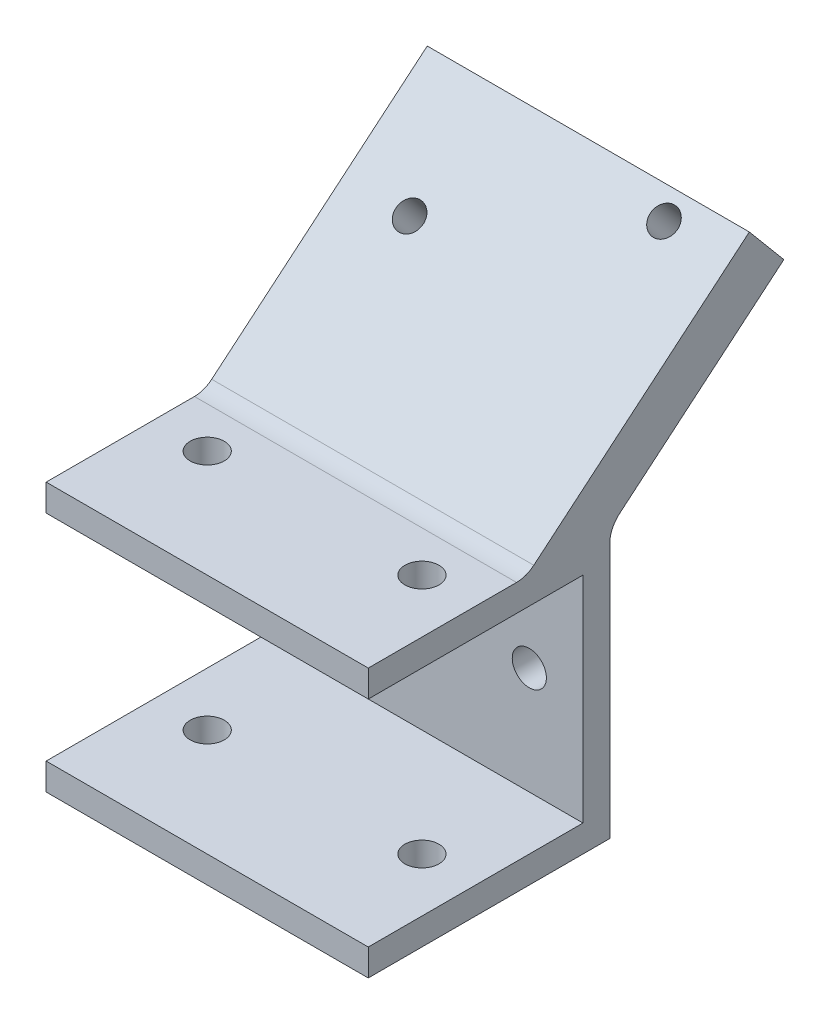
ISO-10303-21;
HEADER;
FILE_DESCRIPTION(('STEP AP214'),'2;1');
FILE_NAME('part.step','',(''),(''),'','','');
FILE_SCHEMA(('AUTOMOTIVE_DESIGN { 1 0 10303 214 1 1 1 1 }'));
ENDSEC;
DATA;
#1=APPLICATION_CONTEXT('core data for automotive mechanical design processes');
#2=APPLICATION_PROTOCOL_DEFINITION('international standard','automotive_design',2000,#1);
#3=PRODUCT_CONTEXT('',#1,'mechanical');
#4=PRODUCT('Part','Part','',(#3));
#5=PRODUCT_RELATED_PRODUCT_CATEGORY('part','',(#4));
#6=PRODUCT_DEFINITION_FORMATION('','',#4);
#7=PRODUCT_DEFINITION_CONTEXT('part definition',#1,'design');
#8=PRODUCT_DEFINITION('design','',#6,#7);
#9=PRODUCT_DEFINITION_SHAPE('','',#8);
#10=(LENGTH_UNIT() NAMED_UNIT(*) SI_UNIT(.MILLI.,.METRE.));
#11=(NAMED_UNIT(*) PLANE_ANGLE_UNIT() SI_UNIT($,.RADIAN.));
#12=(NAMED_UNIT(*) SI_UNIT($,.STERADIAN.) SOLID_ANGLE_UNIT());
#13=UNCERTAINTY_MEASURE_WITH_UNIT(LENGTH_MEASURE(1.E-05),#10,'distance_accuracy_value','');
#14=(GEOMETRIC_REPRESENTATION_CONTEXT(3) GLOBAL_UNCERTAINTY_ASSIGNED_CONTEXT((#13)) GLOBAL_UNIT_ASSIGNED_CONTEXT((#10,
#11,#12)) REPRESENTATION_CONTEXT('',''));
#15=CARTESIAN_POINT('',(0.,0.,0.));
#16=DIRECTION('',(0.,0.,1.));
#17=DIRECTION('',(1.,0.,0.));
#18=AXIS2_PLACEMENT_3D('',#15,#16,#17);
#19=CARTESIAN_POINT('',(38.1,15.875,12.7));
#20=DIRECTION('',(0.,-1.,0.));
#21=DIRECTION('',(0.,0.,-1.));
#22=AXIS2_PLACEMENT_3D('',#19,#20,#21);
#23=PLANE('',#22);
#24=CARTESIAN_POINT('',(31.75,15.875,0.));
#25=DIRECTION('',(0.,1.,0.));
#26=DIRECTION('',(0.,0.,1.));
#27=AXIS2_PLACEMENT_3D('',#24,#25,#26);
#28=CIRCLE('',#27,2.0193);
#29=CARTESIAN_POINT('',(31.75,15.875,2.0193));
#30=VERTEX_POINT('',#29);
#31=EDGE_CURVE('E167',#30,#30,#28,.T.);
#32=ORIENTED_EDGE('',*,*,#31,.F.);
#33=EDGE_LOOP('',(#32));
#34=FACE_BOUND('',#33,.T.);
#35=CARTESIAN_POINT('',(6.35,15.875,0.));
#36=DIRECTION('',(0.,1.,0.));
#37=DIRECTION('',(0.,0.,1.));
#38=AXIS2_PLACEMENT_3D('',#35,#36,#37);
#39=CIRCLE('',#38,2.0193);
#40=CARTESIAN_POINT('',(6.35,15.875,2.0193));
#41=VERTEX_POINT('',#40);
#42=EDGE_CURVE('E169',#41,#41,#39,.T.);
#43=ORIENTED_EDGE('',*,*,#42,.F.);
#44=EDGE_LOOP('',(#43));
#45=FACE_BOUND('',#44,.T.);
#46=DIRECTION('',(0.,0.,1.));
#47=VECTOR('',#46,1.);
#48=CARTESIAN_POINT('',(38.1,15.875,12.7));
#49=LINE('',#48,#47);
#50=CARTESIAN_POINT('',(38.1,15.875,-4.84051284062466));
#51=VERTEX_POINT('',#50);
#52=CARTESIAN_POINT('',(38.1,15.875,12.7));
#53=VERTEX_POINT('',#52);
#54=EDGE_CURVE('E192',#51,#53,#49,.T.);
#55=ORIENTED_EDGE('',*,*,#54,.F.);
#56=DIRECTION('',(1.,0.,0.));
#57=VECTOR('',#56,1.);
#58=CARTESIAN_POINT('',(38.1,15.875,-4.84051284062466));
#59=LINE('',#58,#57);
#60=CARTESIAN_POINT('',(0.,15.875,-4.84051284062466));
#61=VERTEX_POINT('',#60);
#62=EDGE_CURVE('E60',#51,#61,#59,.F.);
#63=ORIENTED_EDGE('',*,*,#62,.T.);
#64=DIRECTION('',(0.,0.,1.));
#65=VECTOR('',#64,1.);
#66=CARTESIAN_POINT('',(0.,15.875,12.7));
#67=LINE('',#66,#65);
#68=CARTESIAN_POINT('',(0.,15.875,12.7));
#69=VERTEX_POINT('',#68);
#70=EDGE_CURVE('E210',#61,#69,#67,.T.);
#71=ORIENTED_EDGE('',*,*,#70,.T.);
#72=DIRECTION('',(-1.,0.,0.));
#73=VECTOR('',#72,1.);
#74=CARTESIAN_POINT('',(38.1,15.875,12.7));
#75=LINE('',#74,#73);
#76=EDGE_CURVE('E240',#53,#69,#75,.T.);
#77=ORIENTED_EDGE('',*,*,#76,.F.);
#78=EDGE_LOOP('',(#55,#63,#71,#77));
#79=FACE_BOUND('',#78,.T.);
#80=ADVANCED_FACE('F37',(#34,#45,#79),#23,.F.);
#81=CARTESIAN_POINT('',(38.1,-15.875,-15.875));
#82=DIRECTION('',(0.,0.,1.));
#83=DIRECTION('',(1.,0.,0.));
#84=AXIS2_PLACEMENT_3D('',#81,#82,#83);
#85=PLANE('',#84);
#86=CARTESIAN_POINT('',(6.35,0.,-15.875));
#87=DIRECTION('',(0.,0.,-1.));
#88=DIRECTION('',(0.,1.,0.));
#89=AXIS2_PLACEMENT_3D('',#86,#87,#88);
#90=CIRCLE('',#89,2.0193);
#91=CARTESIAN_POINT('',(6.35,2.01929999999995,-15.875));
#92=VERTEX_POINT('',#91);
#93=EDGE_CURVE('E262',#92,#92,#90,.T.);
#94=ORIENTED_EDGE('',*,*,#93,.F.);
#95=EDGE_LOOP('',(#94));
#96=FACE_BOUND('',#95,.T.);
#97=CARTESIAN_POINT('',(31.75,0.,-15.875));
#98=DIRECTION('',(0.,0.,-1.));
#99=DIRECTION('',(0.,1.,0.));
#100=AXIS2_PLACEMENT_3D('',#97,#98,#99);
#101=CIRCLE('',#100,2.0193);
#102=CARTESIAN_POINT('',(31.75,2.01929999999994,-15.875));
#103=VERTEX_POINT('',#102);
#104=EDGE_CURVE('E270',#103,#103,#101,.T.);
#105=ORIENTED_EDGE('',*,*,#104,.F.);
#106=EDGE_LOOP('',(#105));
#107=FACE_BOUND('',#106,.T.);
#108=DIRECTION('',(0.,1.,0.));
#109=VECTOR('',#108,1.);
#110=CARTESIAN_POINT('',(0.,-15.875,-15.875));
#111=LINE('',#110,#109);
#112=CARTESIAN_POINT('',(0.,-15.875,-15.875));
#113=VERTEX_POINT('',#112);
#114=CARTESIAN_POINT('',(0.,14.3944663335446,-15.875));
#115=VERTEX_POINT('',#114);
#116=EDGE_CURVE('E188',#113,#115,#111,.T.);
#117=ORIENTED_EDGE('',*,*,#116,.T.);
#118=DIRECTION('',(-1.,0.,0.));
#119=VECTOR('',#118,1.);
#120=CARTESIAN_POINT('',(38.1,14.3944663335446,-15.875));
#121=LINE('',#120,#119);
#122=CARTESIAN_POINT('',(38.1,14.3944663335446,-15.875));
#123=VERTEX_POINT('',#122);
#124=EDGE_CURVE('E248',#115,#123,#121,.F.);
#125=ORIENTED_EDGE('',*,*,#124,.T.);
#126=DIRECTION('',(0.,1.,0.));
#127=VECTOR('',#126,1.);
#128=CARTESIAN_POINT('',(38.1,-15.875,-15.875));
#129=LINE('',#128,#127);
#130=CARTESIAN_POINT('',(38.1,-15.875,-15.875));
#131=VERTEX_POINT('',#130);
#132=EDGE_CURVE('E189',#131,#123,#129,.T.);
#133=ORIENTED_EDGE('',*,*,#132,.F.);
#134=DIRECTION('',(-1.,0.,0.));
#135=VECTOR('',#134,1.);
#136=CARTESIAN_POINT('',(38.1,-15.875,-15.875));
#137=LINE('',#136,#135);
#138=EDGE_CURVE('E207',#131,#113,#137,.T.);
#139=ORIENTED_EDGE('',*,*,#138,.T.);
#140=EDGE_LOOP('',(#117,#125,#133,#139));
#141=FACE_BOUND('',#140,.T.);
#142=ADVANCED_FACE('F286',(#96,#107,#141),#85,.F.);
#143=CARTESIAN_POINT('',(38.1,12.7,12.7));
#144=DIRECTION('',(0.,0.,-1.));
#145=DIRECTION('',(-1.,0.,0.));
#146=AXIS2_PLACEMENT_3D('',#143,#144,#145);
#147=PLANE('',#146);
#148=DIRECTION('',(0.,-1.,0.));
#149=VECTOR('',#148,1.);
#150=CARTESIAN_POINT('',(0.,12.7,12.7));
#151=LINE('',#150,#149);
#152=CARTESIAN_POINT('',(0.,12.7,12.7));
#153=VERTEX_POINT('',#152);
#154=EDGE_CURVE('E212',#69,#153,#151,.T.);
#155=ORIENTED_EDGE('',*,*,#154,.T.);
#156=DIRECTION('',(-1.,0.,0.));
#157=VECTOR('',#156,1.);
#158=CARTESIAN_POINT('',(38.1,12.7,12.7));
#159=LINE('',#158,#157);
#160=CARTESIAN_POINT('',(38.1,12.7,12.7));
#161=VERTEX_POINT('',#160);
#162=EDGE_CURVE('E237',#161,#153,#159,.T.);
#163=ORIENTED_EDGE('',*,*,#162,.F.);
#164=DIRECTION('',(0.,-1.,0.));
#165=VECTOR('',#164,1.);
#166=CARTESIAN_POINT('',(38.1,12.7,12.7));
#167=LINE('',#166,#165);
#168=EDGE_CURVE('E195',#53,#161,#167,.T.);
#169=ORIENTED_EDGE('',*,*,#168,.F.);
#170=ORIENTED_EDGE('',*,*,#76,.T.);
#171=EDGE_LOOP('',(#155,#163,#169,#170));
#172=FACE_BOUND('',#171,.T.);
#173=ADVANCED_FACE('F289',(#172),#147,.F.);
#174=CARTESIAN_POINT('',(38.1,12.7,12.7));
#175=DIRECTION('',(0.,1.,0.));
#176=DIRECTION('',(0.,0.,1.));
#177=AXIS2_PLACEMENT_3D('',#174,#175,#176);
#178=PLANE('',#177);
#179=CARTESIAN_POINT('',(6.35,12.7,0.));
#180=DIRECTION('',(0.,1.,0.));
#181=DIRECTION('',(0.,0.,1.));
#182=AXIS2_PLACEMENT_3D('',#179,#180,#181);
#183=CIRCLE('',#182,2.0193);
#184=CARTESIAN_POINT('',(6.35,12.7,2.0193));
#185=VERTEX_POINT('',#184);
#186=EDGE_CURVE('E185',#185,#185,#183,.T.);
#187=ORIENTED_EDGE('',*,*,#186,.T.);
#188=EDGE_LOOP('',(#187));
#189=FACE_BOUND('',#188,.T.);
#190=CARTESIAN_POINT('',(31.75,12.7,0.));
#191=DIRECTION('',(0.,1.,0.));
#192=DIRECTION('',(0.,0.,1.));
#193=AXIS2_PLACEMENT_3D('',#190,#191,#192);
#194=CIRCLE('',#193,2.0193);
#195=CARTESIAN_POINT('',(31.75,12.7,2.0193));
#196=VERTEX_POINT('',#195);
#197=EDGE_CURVE('E178',#196,#196,#194,.T.);
#198=ORIENTED_EDGE('',*,*,#197,.T.);
#199=EDGE_LOOP('',(#198));
#200=FACE_BOUND('',#199,.T.);
#201=DIRECTION('',(0.,0.,-1.));
#202=VECTOR('',#201,1.);
#203=CARTESIAN_POINT('',(0.,12.7,12.7));
#204=LINE('',#203,#202);
#205=CARTESIAN_POINT('',(0.,12.7,-12.7));
#206=VERTEX_POINT('',#205);
#207=EDGE_CURVE('E214',#153,#206,#204,.T.);
#208=ORIENTED_EDGE('',*,*,#207,.T.);
#209=DIRECTION('',(-1.,0.,0.));
#210=VECTOR('',#209,1.);
#211=CARTESIAN_POINT('',(38.1,12.7,-12.7));
#212=LINE('',#211,#210);
#213=CARTESIAN_POINT('',(38.1,12.7,-12.7));
#214=VERTEX_POINT('',#213);
#215=EDGE_CURVE('E234',#214,#206,#212,.T.);
#216=ORIENTED_EDGE('',*,*,#215,.F.);
#217=DIRECTION('',(0.,0.,-1.));
#218=VECTOR('',#217,1.);
#219=CARTESIAN_POINT('',(38.1,12.7,12.7));
#220=LINE('',#219,#218);
#221=EDGE_CURVE('E197',#161,#214,#220,.T.);
#222=ORIENTED_EDGE('',*,*,#221,.F.);
#223=ORIENTED_EDGE('',*,*,#162,.T.);
#224=EDGE_LOOP('',(#208,#216,#222,#223));
#225=FACE_BOUND('',#224,.T.);
#226=ADVANCED_FACE('F322',(#189,#200,#225),#178,.F.);
#227=CARTESIAN_POINT('',(38.1,-12.7,-12.7));
#228=DIRECTION('',(0.,0.,-1.));
#229=DIRECTION('',(-1.,0.,0.));
#230=AXIS2_PLACEMENT_3D('',#227,#228,#229);
#231=PLANE('',#230);
#232=CARTESIAN_POINT('',(6.35,0.,-12.7));
#233=DIRECTION('',(0.,0.,-1.));
#234=DIRECTION('',(-1.,0.,0.));
#235=AXIS2_PLACEMENT_3D('',#232,#233,#234);
#236=CIRCLE('',#235,2.0193);
#237=CARTESIAN_POINT('',(4.3307,0.,-12.7));
#238=VERTEX_POINT('',#237);
#239=EDGE_CURVE('E164',#238,#238,#236,.T.);
#240=ORIENTED_EDGE('',*,*,#239,.T.);
#241=EDGE_LOOP('',(#240));
#242=FACE_BOUND('',#241,.T.);
#243=CARTESIAN_POINT('',(31.75,0.,-12.7));
#244=DIRECTION('',(0.,0.,-1.));
#245=DIRECTION('',(-1.,0.,0.));
#246=AXIS2_PLACEMENT_3D('',#243,#244,#245);
#247=CIRCLE('',#246,2.0193);
#248=CARTESIAN_POINT('',(29.7307,0.,-12.7));
#249=VERTEX_POINT('',#248);
#250=EDGE_CURVE('E259',#249,#249,#247,.T.);
#251=ORIENTED_EDGE('',*,*,#250,.T.);
#252=EDGE_LOOP('',(#251));
#253=FACE_BOUND('',#252,.T.);
#254=DIRECTION('',(0.,-1.,0.));
#255=VECTOR('',#254,1.);
#256=CARTESIAN_POINT('',(0.,-12.7,-12.7));
#257=LINE('',#256,#255);
#258=CARTESIAN_POINT('',(0.,-12.7,-12.7));
#259=VERTEX_POINT('',#258);
#260=EDGE_CURVE('E216',#206,#259,#257,.T.);
#261=ORIENTED_EDGE('',*,*,#260,.T.);
#262=DIRECTION('',(-1.,0.,0.));
#263=VECTOR('',#262,1.);
#264=CARTESIAN_POINT('',(38.1,-12.7,-12.7));
#265=LINE('',#264,#263);
#266=CARTESIAN_POINT('',(38.1,-12.7,-12.7));
#267=VERTEX_POINT('',#266);
#268=EDGE_CURVE('E231',#267,#259,#265,.T.);
#269=ORIENTED_EDGE('',*,*,#268,.F.);
#270=DIRECTION('',(0.,-1.,0.));
#271=VECTOR('',#270,1.);
#272=CARTESIAN_POINT('',(38.1,-12.7,-12.7));
#273=LINE('',#272,#271);
#274=EDGE_CURVE('E199',#214,#267,#273,.T.);
#275=ORIENTED_EDGE('',*,*,#274,.F.);
#276=ORIENTED_EDGE('',*,*,#215,.T.);
#277=EDGE_LOOP('',(#261,#269,#275,#276));
#278=FACE_BOUND('',#277,.T.);
#279=ADVANCED_FACE('F317',(#242,#253,#278),#231,.F.);
#280=CARTESIAN_POINT('',(38.1,-12.7,12.7));
#281=DIRECTION('',(0.,-1.,0.));
#282=DIRECTION('',(0.,0.,-1.));
#283=AXIS2_PLACEMENT_3D('',#280,#281,#282);
#284=PLANE('',#283);
#285=CARTESIAN_POINT('',(6.35,-12.7,0.));
#286=DIRECTION('',(0.,-1.,0.));
#287=DIRECTION('',(0.,0.,-1.));
#288=AXIS2_PLACEMENT_3D('',#285,#286,#287);
#289=CIRCLE('',#288,2.0193);
#290=CARTESIAN_POINT('',(6.35,-12.7,-2.0193));
#291=VERTEX_POINT('',#290);
#292=EDGE_CURVE('E182',#291,#291,#289,.T.);
#293=ORIENTED_EDGE('',*,*,#292,.T.);
#294=EDGE_LOOP('',(#293));
#295=FACE_BOUND('',#294,.T.);
#296=CARTESIAN_POINT('',(31.75,-12.7,0.));
#297=DIRECTION('',(0.,-1.,0.));
#298=DIRECTION('',(0.,0.,-1.));
#299=AXIS2_PLACEMENT_3D('',#296,#297,#298);
#300=CIRCLE('',#299,2.0193);
#301=CARTESIAN_POINT('',(31.75,-12.7,-2.0193));
#302=VERTEX_POINT('',#301);
#303=EDGE_CURVE('E175',#302,#302,#300,.T.);
#304=ORIENTED_EDGE('',*,*,#303,.T.);
#305=EDGE_LOOP('',(#304));
#306=FACE_BOUND('',#305,.T.);
#307=DIRECTION('',(0.,0.,1.));
#308=VECTOR('',#307,1.);
#309=CARTESIAN_POINT('',(0.,-12.7,12.7));
#310=LINE('',#309,#308);
#311=CARTESIAN_POINT('',(0.,-12.7,12.7));
#312=VERTEX_POINT('',#311);
#313=EDGE_CURVE('E218',#259,#312,#310,.T.);
#314=ORIENTED_EDGE('',*,*,#313,.T.);
#315=DIRECTION('',(-1.,0.,0.));
#316=VECTOR('',#315,1.);
#317=CARTESIAN_POINT('',(38.1,-12.7,12.7));
#318=LINE('',#317,#316);
#319=CARTESIAN_POINT('',(38.1,-12.7,12.7));
#320=VERTEX_POINT('',#319);
#321=EDGE_CURVE('E228',#320,#312,#318,.T.);
#322=ORIENTED_EDGE('',*,*,#321,.F.);
#323=DIRECTION('',(0.,0.,1.));
#324=VECTOR('',#323,1.);
#325=CARTESIAN_POINT('',(38.1,-12.7,12.7));
#326=LINE('',#325,#324);
#327=EDGE_CURVE('E201',#267,#320,#326,.T.);
#328=ORIENTED_EDGE('',*,*,#327,.F.);
#329=ORIENTED_EDGE('',*,*,#268,.T.);
#330=EDGE_LOOP('',(#314,#322,#328,#329));
#331=FACE_BOUND('',#330,.T.);
#332=ADVANCED_FACE('F313',(#295,#306,#331),#284,.F.);
#333=CARTESIAN_POINT('',(38.1,-12.7,12.7));
#334=DIRECTION('',(0.,0.,-1.));
#335=DIRECTION('',(-1.,0.,0.));
#336=AXIS2_PLACEMENT_3D('',#333,#334,#335);
#337=PLANE('',#336);
#338=DIRECTION('',(0.,-1.,0.));
#339=VECTOR('',#338,1.);
#340=CARTESIAN_POINT('',(0.,-12.7,12.7));
#341=LINE('',#340,#339);
#342=CARTESIAN_POINT('',(0.,-15.875,12.7));
#343=VERTEX_POINT('',#342);
#344=EDGE_CURVE('E220',#312,#343,#341,.T.);
#345=ORIENTED_EDGE('',*,*,#344,.T.);
#346=DIRECTION('',(-1.,0.,0.));
#347=VECTOR('',#346,1.);
#348=CARTESIAN_POINT('',(38.1,-15.875,12.7));
#349=LINE('',#348,#347);
#350=CARTESIAN_POINT('',(38.1,-15.875,12.7));
#351=VERTEX_POINT('',#350);
#352=EDGE_CURVE('E225',#351,#343,#349,.T.);
#353=ORIENTED_EDGE('',*,*,#352,.F.);
#354=DIRECTION('',(0.,-1.,0.));
#355=VECTOR('',#354,1.);
#356=CARTESIAN_POINT('',(38.1,-12.7,12.7));
#357=LINE('',#356,#355);
#358=EDGE_CURVE('E203',#320,#351,#357,.T.);
#359=ORIENTED_EDGE('',*,*,#358,.F.);
#360=ORIENTED_EDGE('',*,*,#321,.T.);
#361=EDGE_LOOP('',(#345,#353,#359,#360));
#362=FACE_BOUND('',#361,.T.);
#363=ADVANCED_FACE('F309',(#362),#337,.F.);
#364=CARTESIAN_POINT('',(38.1,-15.875,12.7));
#365=DIRECTION('',(0.,1.,0.));
#366=DIRECTION('',(0.,0.,1.));
#367=AXIS2_PLACEMENT_3D('',#364,#365,#366);
#368=PLANE('',#367);
#369=CARTESIAN_POINT('',(6.35,-15.875,0.));
#370=DIRECTION('',(0.,1.,0.));
#371=DIRECTION('',(0.,0.,1.));
#372=AXIS2_PLACEMENT_3D('',#369,#370,#371);
#373=CIRCLE('',#372,2.0193);
#374=CARTESIAN_POINT('',(6.35,-15.875,2.0193));
#375=VERTEX_POINT('',#374);
#376=EDGE_CURVE('E181',#375,#375,#373,.T.);
#377=ORIENTED_EDGE('',*,*,#376,.T.);
#378=EDGE_LOOP('',(#377));
#379=FACE_BOUND('',#378,.T.);
#380=CARTESIAN_POINT('',(31.75,-15.875,0.));
#381=DIRECTION('',(0.,1.,0.));
#382=DIRECTION('',(0.,0.,1.));
#383=AXIS2_PLACEMENT_3D('',#380,#381,#382);
#384=CIRCLE('',#383,2.0193);
#385=CARTESIAN_POINT('',(31.75,-15.875,2.0193));
#386=VERTEX_POINT('',#385);
#387=EDGE_CURVE('E172',#386,#386,#384,.T.);
#388=ORIENTED_EDGE('',*,*,#387,.T.);
#389=EDGE_LOOP('',(#388));
#390=FACE_BOUND('',#389,.T.);
#391=DIRECTION('',(0.,0.,-1.));
#392=VECTOR('',#391,1.);
#393=CARTESIAN_POINT('',(0.,-15.875,12.7));
#394=LINE('',#393,#392);
#395=EDGE_CURVE('E193',#343,#113,#394,.T.);
#396=ORIENTED_EDGE('',*,*,#395,.T.);
#397=ORIENTED_EDGE('',*,*,#138,.F.);
#398=DIRECTION('',(0.,0.,-1.));
#399=VECTOR('',#398,1.);
#400=CARTESIAN_POINT('',(38.1,-15.875,12.7));
#401=LINE('',#400,#399);
#402=EDGE_CURVE('E205',#351,#131,#401,.T.);
#403=ORIENTED_EDGE('',*,*,#402,.F.);
#404=ORIENTED_EDGE('',*,*,#352,.T.);
#405=EDGE_LOOP('',(#396,#397,#403,#404));
#406=FACE_BOUND('',#405,.T.);
#407=ADVANCED_FACE('F304',(#379,#390,#406),#368,.F.);
#408=CARTESIAN_POINT('',(38.1,0.,0.));
#409=DIRECTION('',(-1.,0.,0.));
#410=DIRECTION('',(0.,0.,1.));
#411=AXIS2_PLACEMENT_3D('',#408,#409,#410);
#412=PLANE('',#411);
#413=ORIENTED_EDGE('',*,*,#132,.T.);
#414=CARTESIAN_POINT('',(38.1,14.3944663335446,-19.05));
#415=DIRECTION('',(-1.,0.,0.));
#416=DIRECTION('',(0.,0.,1.));
#417=AXIS2_PLACEMENT_3D('',#414,#415,#416);
#418=CIRCLE('',#417,3.175);
#419=CARTESIAN_POINT('',(38.1,16.826664675691,-17.0091579619039));
#420=VERTEX_POINT('',#419);
#421=EDGE_CURVE('E256',#123,#420,#418,.T.);
#422=ORIENTED_EDGE('',*,*,#421,.T.);
#423=DIRECTION('',(0.,0.642784893888547,-0.766046721935868));
#424=VECTOR('',#423,1.);
#425=CARTESIAN_POINT('',(38.1,15.875,-15.875));
#426=LINE('',#425,#424);
#427=CARTESIAN_POINT('',(38.1,33.146238,-36.4582081299164));
#428=VERTEX_POINT('',#427);
#429=EDGE_CURVE('E162',#420,#428,#426,.T.);
#430=ORIENTED_EDGE('',*,*,#429,.T.);
#431=DIRECTION('',(0.,0.766046721935868,0.642784893888547));
#432=VECTOR('',#431,1.);
#433=CARTESIAN_POINT('',(38.1,33.146238,-36.4582081299164));
#434=LINE('',#433,#432);
#435=CARTESIAN_POINT('',(38.1,38.0106346842928,-32.3765240537241));
#436=VERTEX_POINT('',#435);
#437=EDGE_CURVE('E151',#428,#436,#434,.T.);
#438=ORIENTED_EDGE('',*,*,#437,.T.);
#439=DIRECTION('',(0.,-0.642784893888547,0.766046721935868));
#440=VECTOR('',#439,1.);
#441=CARTESIAN_POINT('',(38.1,38.0106346842928,-32.3765240537241));
#442=LINE('',#441,#440);
#443=CARTESIAN_POINT('',(38.1,16.6178016578536,-6.8813548787208));
#444=VERTEX_POINT('',#443);
#445=EDGE_CURVE('E144',#436,#444,#442,.T.);
#446=ORIENTED_EDGE('',*,*,#445,.T.);
#447=CARTESIAN_POINT('',(38.1,19.05,-4.84051284062466));
#448=DIRECTION('',(-1.,0.,0.));
#449=DIRECTION('',(0.,0.,1.));
#450=AXIS2_PLACEMENT_3D('',#447,#448,#449);
#451=CIRCLE('',#450,3.175);
#452=EDGE_CURVE('E46',#444,#51,#451,.T.);
#453=ORIENTED_EDGE('',*,*,#452,.T.);
#454=ORIENTED_EDGE('',*,*,#54,.T.);
#455=ORIENTED_EDGE('',*,*,#168,.T.);
#456=ORIENTED_EDGE('',*,*,#221,.T.);
#457=ORIENTED_EDGE('',*,*,#274,.T.);
#458=ORIENTED_EDGE('',*,*,#327,.T.);
#459=ORIENTED_EDGE('',*,*,#358,.T.);
#460=ORIENTED_EDGE('',*,*,#402,.T.);
#461=EDGE_LOOP('',(#413,#422,#430,#438,#446,#453,#454,#455,#456,#457,#458,#459,#460));
#462=FACE_BOUND('',#461,.T.);
#463=ADVANCED_FACE('F299',(#462),#412,.F.);
#464=CARTESIAN_POINT('',(0.,0.,0.));
#465=DIRECTION('',(-1.,0.,0.));
#466=DIRECTION('',(0.,0.,1.));
#467=AXIS2_PLACEMENT_3D('',#464,#465,#466);
#468=PLANE('',#467);
#469=ORIENTED_EDGE('',*,*,#116,.F.);
#470=ORIENTED_EDGE('',*,*,#395,.F.);
#471=ORIENTED_EDGE('',*,*,#344,.F.);
#472=ORIENTED_EDGE('',*,*,#313,.F.);
#473=ORIENTED_EDGE('',*,*,#260,.F.);
#474=ORIENTED_EDGE('',*,*,#207,.F.);
#475=ORIENTED_EDGE('',*,*,#154,.F.);
#476=ORIENTED_EDGE('',*,*,#70,.F.);
#477=CARTESIAN_POINT('',(0.,19.05,-4.84051284062466));
#478=DIRECTION('',(-1.,0.,0.));
#479=DIRECTION('',(0.,0.,1.));
#480=AXIS2_PLACEMENT_3D('',#477,#478,#479);
#481=CIRCLE('',#480,3.175);
#482=CARTESIAN_POINT('',(0.,16.6178016578536,-6.8813548787208));
#483=VERTEX_POINT('',#482);
#484=EDGE_CURVE('E11',#61,#483,#481,.F.);
#485=ORIENTED_EDGE('',*,*,#484,.T.);
#486=DIRECTION('',(0.,-0.642784893888547,0.766046721935868));
#487=VECTOR('',#486,1.);
#488=CARTESIAN_POINT('',(0.,38.0106346842928,-32.3765240537241));
#489=LINE('',#488,#487);
#490=CARTESIAN_POINT('',(0.,38.0106346842928,-32.3765240537241));
#491=VERTEX_POINT('',#490);
#492=EDGE_CURVE('E153',#491,#483,#489,.T.);
#493=ORIENTED_EDGE('',*,*,#492,.F.);
#494=DIRECTION('',(0.,0.766046721935868,0.642784893888547));
#495=VECTOR('',#494,1.);
#496=CARTESIAN_POINT('',(0.,33.146238,-36.4582081299164));
#497=LINE('',#496,#495);
#498=CARTESIAN_POINT('',(0.,33.146238,-36.4582081299164));
#499=VERTEX_POINT('',#498);
#500=EDGE_CURVE('E143',#499,#491,#497,.T.);
#501=ORIENTED_EDGE('',*,*,#500,.F.);
#502=DIRECTION('',(0.,0.642784893888547,-0.766046721935868));
#503=VECTOR('',#502,1.);
#504=CARTESIAN_POINT('',(0.,15.875,-15.875));
#505=LINE('',#504,#503);
#506=CARTESIAN_POINT('',(0.,16.826664675691,-17.0091579619039));
#507=VERTEX_POINT('',#506);
#508=EDGE_CURVE('E133',#507,#499,#505,.T.);
#509=ORIENTED_EDGE('',*,*,#508,.F.);
#510=CARTESIAN_POINT('',(0.,14.3944663335446,-19.05));
#511=DIRECTION('',(-1.,0.,0.));
#512=DIRECTION('',(0.,0.,1.));
#513=AXIS2_PLACEMENT_3D('',#510,#511,#512);
#514=CIRCLE('',#513,3.175);
#515=EDGE_CURVE('E254',#507,#115,#514,.F.);
#516=ORIENTED_EDGE('',*,*,#515,.T.);
#517=EDGE_LOOP('',(#469,#470,#471,#472,#473,#474,#475,#476,#485,#493,#501,#509,#516));
#518=FACE_BOUND('',#517,.T.);
#519=ADVANCED_FACE('F156',(#518),#468,.T.);
#520=CARTESIAN_POINT('',(31.75,-22.987,0.));
#521=DIRECTION('',(0.,1.,0.));
#522=DIRECTION('',(0.,0.,1.));
#523=AXIS2_PLACEMENT_3D('',#520,#521,#522);
#524=CYLINDRICAL_SURFACE('',#523,2.0193);
#525=ORIENTED_EDGE('',*,*,#387,.F.);
#526=EDGE_LOOP('',(#525));
#527=FACE_BOUND('',#526,.T.);
#528=ORIENTED_EDGE('',*,*,#303,.F.);
#529=EDGE_LOOP('',(#528));
#530=FACE_BOUND('',#529,.T.);
#531=ADVANCED_FACE('F373',(#527,#530),#524,.F.);
#532=CARTESIAN_POINT('',(6.35,-22.987,0.));
#533=DIRECTION('',(0.,1.,0.));
#534=DIRECTION('',(0.,0.,1.));
#535=AXIS2_PLACEMENT_3D('',#532,#533,#534);
#536=CYLINDRICAL_SURFACE('',#535,2.0193);
#537=ORIENTED_EDGE('',*,*,#376,.F.);
#538=EDGE_LOOP('',(#537));
#539=FACE_BOUND('',#538,.T.);
#540=ORIENTED_EDGE('',*,*,#292,.F.);
#541=EDGE_LOOP('',(#540));
#542=FACE_BOUND('',#541,.T.);
#543=ADVANCED_FACE('F346',(#539,#542),#536,.F.);
#544=ORIENTED_EDGE('',*,*,#31,.T.);
#545=EDGE_LOOP('',(#544));
#546=FACE_BOUND('',#545,.T.);
#547=ORIENTED_EDGE('',*,*,#197,.F.);
#548=EDGE_LOOP('',(#547));
#549=FACE_BOUND('',#548,.T.);
#550=ADVANCED_FACE('F343',(#546,#549),#524,.F.);
#551=ORIENTED_EDGE('',*,*,#42,.T.);
#552=EDGE_LOOP('',(#551));
#553=FACE_BOUND('',#552,.T.);
#554=ORIENTED_EDGE('',*,*,#186,.F.);
#555=EDGE_LOOP('',(#554));
#556=FACE_BOUND('',#555,.T.);
#557=ADVANCED_FACE('F335',(#553,#556),#536,.F.);
#558=CARTESIAN_POINT('',(0.,38.0106346842928,-32.3765240537241));
#559=DIRECTION('',(0.,0.766046721935868,0.642784893888547));
#560=DIRECTION('',(0.,-0.642784893888547,0.766046721935868));
#561=AXIS2_PLACEMENT_3D('',#558,#559,#560);
#562=PLANE('',#561);
#563=CARTESIAN_POINT('',(7.95,29.5901525743528,-22.3413119963642));
#564=DIRECTION('',(0.,0.766046721935868,0.642784893888547));
#565=DIRECTION('',(0.,-0.642784893888547,0.766046721935868));
#566=AXIS2_PLACEMENT_3D('',#563,#564,#565);
#567=CIRCLE('',#566,1.625);
#568=CARTESIAN_POINT('',(7.95,28.5456271217839,-21.0964860732185));
#569=VERTEX_POINT('',#568);
#570=EDGE_CURVE('E266',#569,#569,#567,.T.);
#571=ORIENTED_EDGE('',*,*,#570,.F.);
#572=EDGE_LOOP('',(#571));
#573=FACE_BOUND('',#572,.T.);
#574=CARTESIAN_POINT('',(30.15,36.2108369814048,-30.2315932323037));
#575=DIRECTION('',(0.,0.766046721935868,0.642784893888547));
#576=DIRECTION('',(0.,-0.642784893888547,0.766046721935868));
#577=AXIS2_PLACEMENT_3D('',#574,#575,#576);
#578=CIRCLE('',#577,1.62500000000001);
#579=CARTESIAN_POINT('',(30.15,35.1663115288359,-28.9867673091579));
#580=VERTEX_POINT('',#579);
#581=EDGE_CURVE('E272',#580,#580,#578,.T.);
#582=ORIENTED_EDGE('',*,*,#581,.F.);
#583=EDGE_LOOP('',(#582));
#584=FACE_BOUND('',#583,.T.);
#585=ORIENTED_EDGE('',*,*,#492,.T.);
#586=DIRECTION('',(1.,0.,0.));
#587=VECTOR('',#586,1.);
#588=CARTESIAN_POINT('',(0.,16.6178016578536,-6.8813548787208));
#589=LINE('',#588,#587);
#590=EDGE_CURVE('E250',#483,#444,#589,.T.);
#591=ORIENTED_EDGE('',*,*,#590,.T.);
#592=ORIENTED_EDGE('',*,*,#445,.F.);
#593=DIRECTION('',(1.,0.,0.));
#594=VECTOR('',#593,1.);
#595=CARTESIAN_POINT('',(0.,38.0106346842928,-32.3765240537241));
#596=LINE('',#595,#594);
#597=EDGE_CURVE('E152',#491,#436,#596,.T.);
#598=ORIENTED_EDGE('',*,*,#597,.F.);
#599=EDGE_LOOP('',(#585,#591,#592,#598));
#600=FACE_BOUND('',#599,.T.);
#601=ADVANCED_FACE('F333',(#573,#584,#600),#562,.T.);
#602=CARTESIAN_POINT('',(0.,33.146238,-36.4582081299164));
#603=DIRECTION('',(0.,0.642784893888548,-0.766046721935868));
#604=DIRECTION('',(0.,0.766046721935868,0.642784893888547));
#605=AXIS2_PLACEMENT_3D('',#602,#603,#604);
#606=PLANE('',#605);
#607=ORIENTED_EDGE('',*,*,#437,.F.);
#608=DIRECTION('',(1.,0.,0.));
#609=VECTOR('',#608,1.);
#610=CARTESIAN_POINT('',(0.,33.146238,-36.4582081299164));
#611=LINE('',#610,#609);
#612=EDGE_CURVE('E137',#499,#428,#611,.T.);
#613=ORIENTED_EDGE('',*,*,#612,.F.);
#614=ORIENTED_EDGE('',*,*,#500,.T.);
#615=ORIENTED_EDGE('',*,*,#597,.T.);
#616=EDGE_LOOP('',(#607,#613,#614,#615));
#617=FACE_BOUND('',#616,.T.);
#618=ADVANCED_FACE('F148',(#617),#606,.T.);
#619=CARTESIAN_POINT('',(0.,15.875,-15.875));
#620=DIRECTION('',(0.,-0.766046721935868,-0.642784893888547));
#621=DIRECTION('',(0.,0.642784893888547,-0.766046721935868));
#622=AXIS2_PLACEMENT_3D('',#619,#620,#621);
#623=PLANE('',#622);
#624=CARTESIAN_POINT('',(7.95,24.72575589006,-26.4229960725565));
#625=DIRECTION('',(0.,-0.766046721935868,-0.642784893888547));
#626=DIRECTION('',(0.,0.642784893888547,-0.766046721935868));
#627=AXIS2_PLACEMENT_3D('',#624,#625,#626);
#628=CIRCLE('',#627,1.625);
#629=CARTESIAN_POINT('',(7.95,25.7702813426289,-27.6678219957023));
#630=VERTEX_POINT('',#629);
#631=EDGE_CURVE('E41',#630,#630,#628,.T.);
#632=ORIENTED_EDGE('',*,*,#631,.F.);
#633=EDGE_LOOP('',(#632));
#634=FACE_BOUND('',#633,.T.);
#635=CARTESIAN_POINT('',(30.15,31.3464402971121,-34.313277308496));
#636=DIRECTION('',(0.,-0.766046721935868,-0.642784893888547));
#637=DIRECTION('',(0.,0.642784893888547,-0.766046721935868));
#638=AXIS2_PLACEMENT_3D('',#635,#636,#637);
#639=CIRCLE('',#638,1.62500000000001);
#640=CARTESIAN_POINT('',(30.15,32.390965749681,-35.5581032316418));
#641=VERTEX_POINT('',#640);
#642=EDGE_CURVE('E264',#641,#641,#639,.T.);
#643=ORIENTED_EDGE('',*,*,#642,.F.);
#644=EDGE_LOOP('',(#643));
#645=FACE_BOUND('',#644,.T.);
#646=ORIENTED_EDGE('',*,*,#429,.F.);
#647=DIRECTION('',(-1.,0.,0.));
#648=VECTOR('',#647,1.);
#649=CARTESIAN_POINT('',(0.,16.826664675691,-17.0091579619039));
#650=LINE('',#649,#648);
#651=EDGE_CURVE('E140',#420,#507,#650,.T.);
#652=ORIENTED_EDGE('',*,*,#651,.T.);
#653=ORIENTED_EDGE('',*,*,#508,.T.);
#654=ORIENTED_EDGE('',*,*,#612,.T.);
#655=EDGE_LOOP('',(#646,#652,#653,#654));
#656=FACE_BOUND('',#655,.T.);
#657=ADVANCED_FACE('F136',(#634,#645,#656),#623,.T.);
#658=CARTESIAN_POINT('',(0.,14.3944663335446,-19.05));
#659=DIRECTION('',(-1.,0.,0.));
#660=DIRECTION('',(0.,0.,1.));
#661=AXIS2_PLACEMENT_3D('',#658,#659,#660);
#662=CYLINDRICAL_SURFACE('',#661,3.175);
#663=ORIENTED_EDGE('',*,*,#421,.F.);
#664=ORIENTED_EDGE('',*,*,#124,.F.);
#665=ORIENTED_EDGE('',*,*,#515,.F.);
#666=ORIENTED_EDGE('',*,*,#651,.F.);
#667=EDGE_LOOP('',(#663,#664,#665,#666));
#668=FACE_BOUND('',#667,.T.);
#669=ADVANCED_FACE('F298',(#668),#662,.F.);
#670=CARTESIAN_POINT('',(0.,19.05,-4.84051284062466));
#671=DIRECTION('',(1.,0.,0.));
#672=DIRECTION('',(0.,0.,-1.));
#673=AXIS2_PLACEMENT_3D('',#670,#671,#672);
#674=CYLINDRICAL_SURFACE('',#673,3.175);
#675=ORIENTED_EDGE('',*,*,#484,.F.);
#676=ORIENTED_EDGE('',*,*,#62,.F.);
#677=ORIENTED_EDGE('',*,*,#452,.F.);
#678=ORIENTED_EDGE('',*,*,#590,.F.);
#679=EDGE_LOOP('',(#675,#676,#677,#678));
#680=FACE_BOUND('',#679,.T.);
#681=ADVANCED_FACE('F39',(#680),#674,.F.);
#682=CARTESIAN_POINT('',(31.75,0.,22.987));
#683=DIRECTION('',(0.,0.,-1.));
#684=DIRECTION('',(0.,1.,0.));
#685=AXIS2_PLACEMENT_3D('',#682,#683,#684);
#686=CYLINDRICAL_SURFACE('',#685,2.0193);
#687=ORIENTED_EDGE('',*,*,#104,.T.);
#688=EDGE_LOOP('',(#687));
#689=FACE_BOUND('',#688,.T.);
#690=ORIENTED_EDGE('',*,*,#250,.F.);
#691=EDGE_LOOP('',(#690));
#692=FACE_BOUND('',#691,.T.);
#693=ADVANCED_FACE('F283',(#689,#692),#686,.F.);
#694=CARTESIAN_POINT('',(6.35,0.,22.987));
#695=DIRECTION('',(0.,0.,-1.));
#696=DIRECTION('',(0.,1.,0.));
#697=AXIS2_PLACEMENT_3D('',#694,#695,#696);
#698=CYLINDRICAL_SURFACE('',#697,2.0193);
#699=ORIENTED_EDGE('',*,*,#93,.T.);
#700=EDGE_LOOP('',(#699));
#701=FACE_BOUND('',#700,.T.);
#702=ORIENTED_EDGE('',*,*,#239,.F.);
#703=EDGE_LOOP('',(#702));
#704=FACE_BOUND('',#703,.T.);
#705=ADVANCED_FACE('F425',(#701,#704),#698,.F.);
#706=CARTESIAN_POINT('',(30.15,14.3210519020874,-48.5991715751689));
#707=DIRECTION('',(0.,0.766046721935868,0.642784893888547));
#708=DIRECTION('',(0.,-0.642784893888547,0.766046721935868));
#709=AXIS2_PLACEMENT_3D('',#706,#707,#708);
#710=CYLINDRICAL_SURFACE('',#709,1.62500000000001);
#711=ORIENTED_EDGE('',*,*,#642,.T.);
#712=EDGE_LOOP('',(#711));
#713=FACE_BOUND('',#712,.T.);
#714=ORIENTED_EDGE('',*,*,#581,.T.);
#715=EDGE_LOOP('',(#714));
#716=FACE_BOUND('',#715,.T.);
#717=ADVANCED_FACE('F432',(#713,#716),#710,.F.);
#718=CARTESIAN_POINT('',(7.95,7.70036749503538,-40.7088903392295));
#719=DIRECTION('',(0.,0.766046721935868,0.642784893888547));
#720=DIRECTION('',(0.,-0.642784893888547,0.766046721935868));
#721=AXIS2_PLACEMENT_3D('',#718,#719,#720);
#722=CYLINDRICAL_SURFACE('',#721,1.625);
#723=ORIENTED_EDGE('',*,*,#631,.T.);
#724=EDGE_LOOP('',(#723));
#725=FACE_BOUND('',#724,.T.);
#726=ORIENTED_EDGE('',*,*,#570,.T.);
#727=EDGE_LOOP('',(#726));
#728=FACE_BOUND('',#727,.T.);
#729=ADVANCED_FACE('F454',(#725,#728),#722,.F.);
#730=CLOSED_SHELL('',(#80,#142,#173,#226,#279,#332,#363,#407,#463,#519,#531,#543,#550,#557,#601,
#618,#657,#669,#681,#693,#705,#717,#729));
#731=MANIFOLD_SOLID_BREP('B2',#730);
#732=ADVANCED_BREP_SHAPE_REPRESENTATION('',(#18,#731),#14);
#733=SHAPE_DEFINITION_REPRESENTATION(#9,#732);
ENDSEC;
END-ISO-10303-21;
